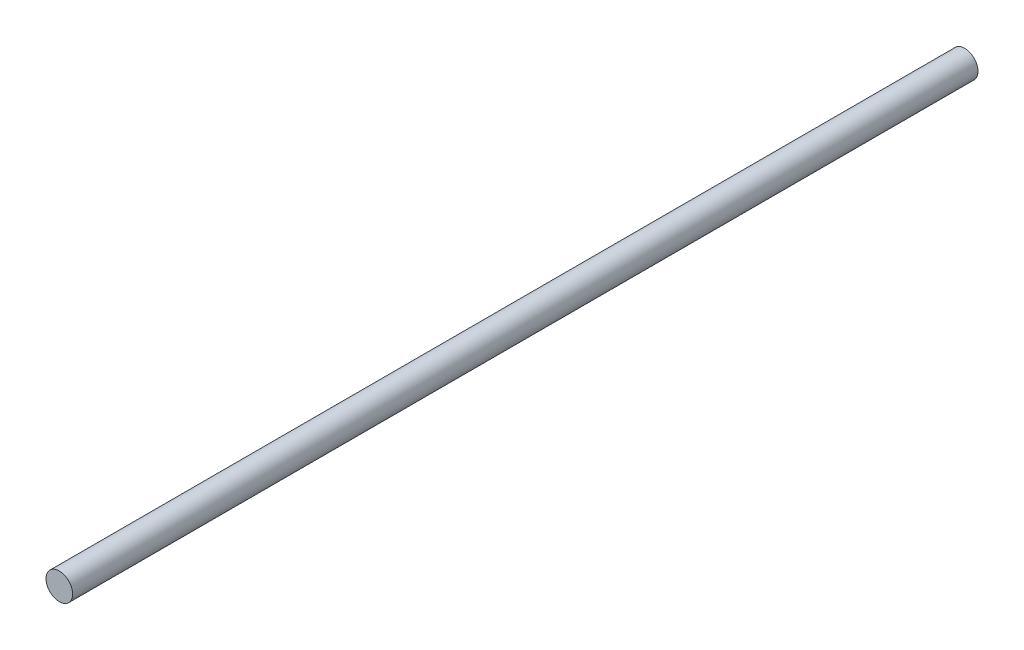
ISO-10303-21;
HEADER;
FILE_DESCRIPTION(('STEP AP214'),'2;1');
FILE_NAME('part.step','',(''),(''),'','','');
FILE_SCHEMA(('AUTOMOTIVE_DESIGN { 1 0 10303 214 1 1 1 1 }'));
ENDSEC;
DATA;
#1=APPLICATION_CONTEXT('core data for automotive mechanical design processes');
#2=APPLICATION_PROTOCOL_DEFINITION('international standard','automotive_design',2000,#1);
#3=PRODUCT_CONTEXT('',#1,'mechanical');
#4=PRODUCT('Part','Part','',(#3));
#5=PRODUCT_RELATED_PRODUCT_CATEGORY('part','',(#4));
#6=PRODUCT_DEFINITION_FORMATION('','',#4);
#7=PRODUCT_DEFINITION_CONTEXT('part definition',#1,'design');
#8=PRODUCT_DEFINITION('design','',#6,#7);
#9=PRODUCT_DEFINITION_SHAPE('','',#8);
#10=(LENGTH_UNIT() NAMED_UNIT(*) SI_UNIT(.MILLI.,.METRE.));
#11=(NAMED_UNIT(*) PLANE_ANGLE_UNIT() SI_UNIT($,.RADIAN.));
#12=(NAMED_UNIT(*) SI_UNIT($,.STERADIAN.) SOLID_ANGLE_UNIT());
#13=UNCERTAINTY_MEASURE_WITH_UNIT(LENGTH_MEASURE(1.E-05),#10,'distance_accuracy_value','');
#14=(GEOMETRIC_REPRESENTATION_CONTEXT(3) GLOBAL_UNCERTAINTY_ASSIGNED_CONTEXT((#13)) GLOBAL_UNIT_ASSIGNED_CONTEXT((#10,
#11,#12)) REPRESENTATION_CONTEXT('',''));
#15=CARTESIAN_POINT('',(0.,0.,0.));
#16=DIRECTION('',(0.,0.,1.));
#17=DIRECTION('',(1.,0.,0.));
#18=AXIS2_PLACEMENT_3D('',#15,#16,#17);
#19=CARTESIAN_POINT('',(-582.369900343548,124.910580717197,0.));
#20=DIRECTION('',(0.,0.,1.));
#21=DIRECTION('',(1.,0.,0.));
#22=AXIS2_PLACEMENT_3D('',#19,#20,#21);
#23=PLANE('',#22);
#24=CARTESIAN_POINT('',(-582.369900343548,124.910580717197,0.));
#25=DIRECTION('',(0.,0.,1.));
#26=DIRECTION('',(1.,0.,0.));
#27=AXIS2_PLACEMENT_3D('',#24,#25,#26);
#28=CIRCLE('',#27,3.99999999999999);
#29=CARTESIAN_POINT('',(-578.369900343548,124.910580717197,0.));
#30=VERTEX_POINT('',#29);
#31=EDGE_CURVE('E38',#30,#30,#28,.T.);
#32=ORIENTED_EDGE('',*,*,#31,.F.);
#33=EDGE_LOOP('',(#32));
#34=FACE_BOUND('',#33,.T.);
#35=ADVANCED_FACE('F31',(#34),#23,.F.);
#36=CARTESIAN_POINT('',(-582.369900343548,124.910580717197,283.313708498985));
#37=DIRECTION('',(0.,0.,-1.));
#38=DIRECTION('',(-1.,0.,0.));
#39=AXIS2_PLACEMENT_3D('',#36,#37,#38);
#40=CYLINDRICAL_SURFACE('',#39,3.99999999999999);
#41=CARTESIAN_POINT('',(-582.369900343548,124.910580717197,272.));
#42=DIRECTION('',(0.,0.,-1.));
#43=DIRECTION('',(0.,1.,0.));
#44=AXIS2_PLACEMENT_3D('',#41,#42,#43);
#45=CIRCLE('',#44,3.99999999999999);
#46=CARTESIAN_POINT('',(-582.369900343548,128.910580717197,272.));
#47=VERTEX_POINT('',#46);
#48=EDGE_CURVE('E10',#47,#47,#45,.T.);
#49=ORIENTED_EDGE('',*,*,#48,.T.);
#50=EDGE_LOOP('',(#49));
#51=FACE_BOUND('',#50,.T.);
#52=ORIENTED_EDGE('',*,*,#31,.T.);
#53=EDGE_LOOP('',(#52));
#54=FACE_BOUND('',#53,.T.);
#55=ADVANCED_FACE('F33',(#51,#54),#40,.T.);
#56=CARTESIAN_POINT('',(-582.369900343547,158.910580717199,272.));
#57=DIRECTION('',(0.,0.,-1.));
#58=DIRECTION('',(-1.,0.,0.));
#59=AXIS2_PLACEMENT_3D('',#56,#57,#58);
#60=PLANE('',#59);
#61=ORIENTED_EDGE('',*,*,#48,.F.);
#62=EDGE_LOOP('',(#61));
#63=FACE_BOUND('',#62,.T.);
#64=ADVANCED_FACE('F49',(#63),#60,.F.);
#65=CLOSED_SHELL('',(#35,#55,#64));
#66=MANIFOLD_SOLID_BREP('B2',#65);
#67=ADVANCED_BREP_SHAPE_REPRESENTATION('',(#18,#66),#14);
#68=SHAPE_DEFINITION_REPRESENTATION(#9,#67);
ENDSEC;
END-ISO-10303-21;
